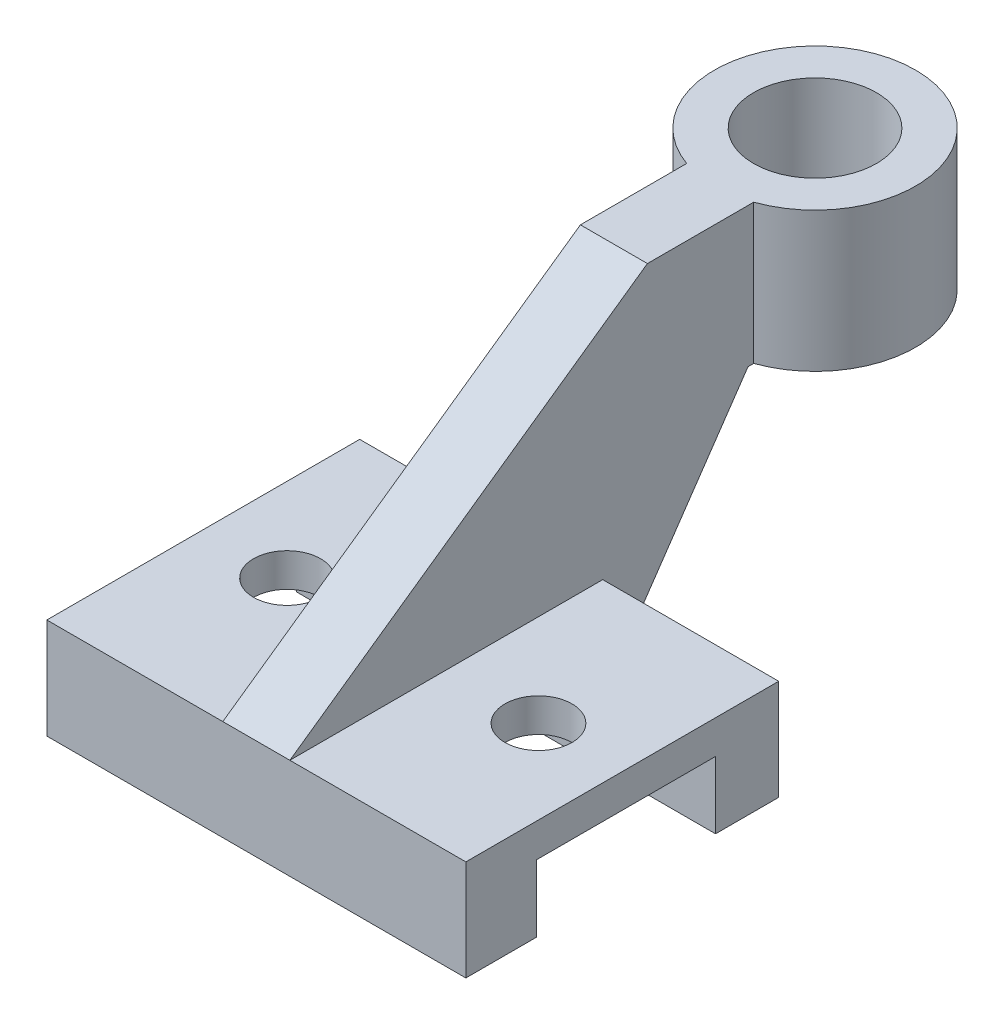
ISO-10303-21;
HEADER;
FILE_DESCRIPTION(('STEP AP214'),'2;1');
FILE_NAME('part.step','',(''),(''),'','','');
FILE_SCHEMA(('AUTOMOTIVE_DESIGN { 1 0 10303 214 1 1 1 1 }'));
ENDSEC;
DATA;
#1=APPLICATION_CONTEXT('core data for automotive mechanical design processes');
#2=APPLICATION_PROTOCOL_DEFINITION('international standard','automotive_design',2000,#1);
#3=PRODUCT_CONTEXT('',#1,'mechanical');
#4=PRODUCT('Part','Part','',(#3));
#5=PRODUCT_RELATED_PRODUCT_CATEGORY('part','',(#4));
#6=PRODUCT_DEFINITION_FORMATION('','',#4);
#7=PRODUCT_DEFINITION_CONTEXT('part definition',#1,'design');
#8=PRODUCT_DEFINITION('design','',#6,#7);
#9=PRODUCT_DEFINITION_SHAPE('','',#8);
#10=(LENGTH_UNIT() NAMED_UNIT(*) SI_UNIT(.MILLI.,.METRE.));
#11=(NAMED_UNIT(*) PLANE_ANGLE_UNIT() SI_UNIT($,.RADIAN.));
#12=(NAMED_UNIT(*) SI_UNIT($,.STERADIAN.) SOLID_ANGLE_UNIT());
#13=UNCERTAINTY_MEASURE_WITH_UNIT(LENGTH_MEASURE(1.E-05),#10,'distance_accuracy_value','');
#14=(GEOMETRIC_REPRESENTATION_CONTEXT(3) GLOBAL_UNCERTAINTY_ASSIGNED_CONTEXT((#13)) GLOBAL_UNIT_ASSIGNED_CONTEXT((#10,
#11,#12)) REPRESENTATION_CONTEXT('',''));
#15=CARTESIAN_POINT('',(0.,0.,0.));
#16=DIRECTION('',(0.,0.,1.));
#17=DIRECTION('',(1.,0.,0.));
#18=AXIS2_PLACEMENT_3D('',#15,#16,#17);
#19=CARTESIAN_POINT('',(952.5,367.568586387434,-1523.46806282722));
#20=DIRECTION('',(0.,1.,0.));
#21=DIRECTION('',(0.,0.,1.));
#22=AXIS2_PLACEMENT_3D('',#19,#20,#21);
#23=CYLINDRICAL_SURFACE('',#22,457.2);
#24=CARTESIAN_POINT('',(952.5,1002.56858638743,-1523.46806282722));
#25=DIRECTION('',(0.,1.,0.));
#26=DIRECTION('',(0.,0.,1.));
#27=AXIS2_PLACEMENT_3D('',#24,#25,#26);
#28=CIRCLE('',#27,457.2);
#29=CARTESIAN_POINT('',(1104.9,1002.56858638743,-1092.4157690159));
#30=VERTEX_POINT('',#29);
#31=CARTESIAN_POINT('',(800.1,1002.56858638743,-1092.4157690159));
#32=VERTEX_POINT('',#31);
#33=EDGE_CURVE('E43',#30,#32,#28,.T.);
#34=ORIENTED_EDGE('',*,*,#33,.F.);
#35=DIRECTION('',(0.,1.,0.));
#36=VECTOR('',#35,1.);
#37=CARTESIAN_POINT('',(1104.9,367.568586387434,-1092.4157690159));
#38=LINE('',#37,#36);
#39=CARTESIAN_POINT('',(1104.9,367.568586387434,-1092.4157690159));
#40=VERTEX_POINT('',#39);
#41=EDGE_CURVE('E150',#30,#40,#38,.F.);
#42=ORIENTED_EDGE('',*,*,#41,.T.);
#43=CARTESIAN_POINT('',(952.5,367.568586387434,-1523.46806282722));
#44=DIRECTION('',(0.,1.,0.));
#45=DIRECTION('',(0.,0.,1.));
#46=AXIS2_PLACEMENT_3D('',#43,#44,#45);
#47=CIRCLE('',#46,457.2);
#48=CARTESIAN_POINT('',(800.1,367.568586387434,-1092.4157690159));
#49=VERTEX_POINT('',#48);
#50=EDGE_CURVE('E11',#40,#49,#47,.T.);
#51=ORIENTED_EDGE('',*,*,#50,.T.);
#52=DIRECTION('',(0.,1.,0.));
#53=VECTOR('',#52,1.);
#54=CARTESIAN_POINT('',(800.1,367.568586387434,-1092.4157690159));
#55=LINE('',#54,#53);
#56=EDGE_CURVE('E268',#49,#32,#55,.T.);
#57=ORIENTED_EDGE('',*,*,#56,.T.);
#58=EDGE_LOOP('',(#34,#42,#51,#57));
#59=FACE_BOUND('',#58,.T.);
#60=ADVANCED_FACE('F40',(#59),#23,.T.);
#61=CARTESIAN_POINT('',(952.5,367.568586387434,-1523.46806282722));
#62=DIRECTION('',(0.,1.,0.));
#63=DIRECTION('',(0.,0.,1.));
#64=AXIS2_PLACEMENT_3D('',#61,#62,#63);
#65=PLANE('',#64);
#66=ORIENTED_EDGE('',*,*,#50,.F.);
#67=DIRECTION('',(0.,0.,1.));
#68=VECTOR('',#67,1.);
#69=CARTESIAN_POINT('',(1104.9,367.568586387434,-1218.66806282722));
#70=LINE('',#69,#68);
#71=CARTESIAN_POINT('',(1104.9,367.568586387434,-1066.26806282722));
#72=VERTEX_POINT('',#71);
#73=EDGE_CURVE('E61',#40,#72,#70,.T.);
#74=ORIENTED_EDGE('',*,*,#73,.T.);
#75=DIRECTION('',(-1.,0.,0.));
#76=VECTOR('',#75,1.);
#77=CARTESIAN_POINT('',(800.1,367.568586387434,-1066.26806282722));
#78=LINE('',#77,#76);
#79=CARTESIAN_POINT('',(800.1,367.568586387434,-1066.26806282722));
#80=VERTEX_POINT('',#79);
#81=EDGE_CURVE('E153',#72,#80,#78,.T.);
#82=ORIENTED_EDGE('',*,*,#81,.T.);
#83=DIRECTION('',(0.,0.,1.));
#84=VECTOR('',#83,1.);
#85=CARTESIAN_POINT('',(800.1,367.568586387434,-1218.66806282722));
#86=LINE('',#85,#84);
#87=EDGE_CURVE('E264',#49,#80,#86,.T.);
#88=ORIENTED_EDGE('',*,*,#87,.F.);
#89=EDGE_LOOP('',(#66,#74,#82,#88));
#90=FACE_BOUND('',#89,.T.);
#91=CARTESIAN_POINT('',(952.5,367.568586387434,-1523.46806282722));
#92=DIRECTION('',(0.,1.,0.));
#93=DIRECTION('',(0.,0.,1.));
#94=AXIS2_PLACEMENT_3D('',#91,#92,#93);
#95=CIRCLE('',#94,279.4);
#96=CARTESIAN_POINT('',(952.5,367.568586387434,-1244.06806282722));
#97=VERTEX_POINT('',#96);
#98=EDGE_CURVE('E273',#97,#97,#95,.T.);
#99=ORIENTED_EDGE('',*,*,#98,.T.);
#100=EDGE_LOOP('',(#99));
#101=FACE_BOUND('',#100,.T.);
#102=ADVANCED_FACE('F281',(#90,#101),#65,.F.);
#103=CARTESIAN_POINT('',(952.5,1002.56858638743,-1523.46806282722));
#104=DIRECTION('',(0.,1.,0.));
#105=DIRECTION('',(0.,0.,1.));
#106=AXIS2_PLACEMENT_3D('',#103,#104,#105);
#107=PLANE('',#106);
#108=ORIENTED_EDGE('',*,*,#33,.T.);
#109=DIRECTION('',(0.,0.,1.));
#110=VECTOR('',#109,1.);
#111=CARTESIAN_POINT('',(800.1,1002.56858638743,-1218.66806282722));
#112=LINE('',#111,#110);
#113=CARTESIAN_POINT('',(800.1,1002.56858638743,-609.068062827224));
#114=VERTEX_POINT('',#113);
#115=EDGE_CURVE('E152',#32,#114,#112,.T.);
#116=ORIENTED_EDGE('',*,*,#115,.T.);
#117=DIRECTION('',(1.,0.,0.));
#118=VECTOR('',#117,1.);
#119=CARTESIAN_POINT('',(800.1,1002.56858638743,-609.068062827224));
#120=LINE('',#119,#118);
#121=CARTESIAN_POINT('',(1104.9,1002.56858638743,-609.068062827224));
#122=VERTEX_POINT('',#121);
#123=EDGE_CURVE('E156',#114,#122,#120,.T.);
#124=ORIENTED_EDGE('',*,*,#123,.T.);
#125=DIRECTION('',(0.,0.,1.));
#126=VECTOR('',#125,1.);
#127=CARTESIAN_POINT('',(1104.9,1002.56858638743,-1218.66806282722));
#128=LINE('',#127,#126);
#129=EDGE_CURVE('E54',#30,#122,#128,.T.);
#130=ORIENTED_EDGE('',*,*,#129,.F.);
#131=EDGE_LOOP('',(#108,#116,#124,#130));
#132=FACE_BOUND('',#131,.T.);
#133=CARTESIAN_POINT('',(952.5,1002.56858638743,-1523.46806282722));
#134=DIRECTION('',(0.,1.,0.));
#135=DIRECTION('',(0.,0.,1.));
#136=AXIS2_PLACEMENT_3D('',#133,#134,#135);
#137=CIRCLE('',#136,279.4);
#138=CARTESIAN_POINT('',(952.5,1002.56858638743,-1244.06806282722));
#139=VERTEX_POINT('',#138);
#140=EDGE_CURVE('E272',#139,#139,#137,.T.);
#141=ORIENTED_EDGE('',*,*,#140,.F.);
#142=EDGE_LOOP('',(#141));
#143=FACE_BOUND('',#142,.T.);
#144=ADVANCED_FACE('F157',(#132,#143),#107,.T.);
#145=CARTESIAN_POINT('',(952.5,367.568586387434,-1523.46806282722));
#146=DIRECTION('',(0.,1.,0.));
#147=DIRECTION('',(0.,0.,1.));
#148=AXIS2_PLACEMENT_3D('',#145,#146,#147);
#149=CYLINDRICAL_SURFACE('',#148,279.4);
#150=ORIENTED_EDGE('',*,*,#98,.F.);
#151=EDGE_LOOP('',(#150));
#152=FACE_BOUND('',#151,.T.);
#153=ORIENTED_EDGE('',*,*,#140,.T.);
#154=EDGE_LOOP('',(#153));
#155=FACE_BOUND('',#154,.T.);
#156=ADVANCED_FACE('F279',(#152,#155),#149,.F.);
#157=CARTESIAN_POINT('',(1104.9,367.568586387434,-1218.66806282722));
#158=DIRECTION('',(-1.,0.,0.));
#159=DIRECTION('',(0.,0.,1.));
#160=AXIS2_PLACEMENT_3D('',#157,#158,#159);
#161=PLANE('',#160);
#162=ORIENTED_EDGE('',*,*,#41,.F.);
#163=ORIENTED_EDGE('',*,*,#129,.T.);
#164=DIRECTION('',(0.,-0.575176751990256,0.818029158386142));
#165=VECTOR('',#164,1.);
#166=CARTESIAN_POINT('',(1104.9,1002.56858638743,-609.068062827224));
#167=LINE('',#166,#165);
#168=CARTESIAN_POINT('',(1104.9,-140.431413612566,1016.53193717278));
#169=VERTEX_POINT('',#168);
#170=EDGE_CURVE('E149',#122,#169,#167,.T.);
#171=ORIENTED_EDGE('',*,*,#170,.T.);
#172=DIRECTION('',(0.,0.,-1.));
#173=VECTOR('',#172,1.);
#174=CARTESIAN_POINT('',(1104.9,-140.431413612566,1016.53193717278));
#175=LINE('',#174,#173);
#176=CARTESIAN_POINT('',(1104.9,-140.431413612566,-405.868062827224));
#177=VERTEX_POINT('',#176);
#178=EDGE_CURVE('E168',#169,#177,#175,.T.);
#179=ORIENTED_EDGE('',*,*,#178,.T.);
#180=DIRECTION('',(0.,-1.,0.));
#181=VECTOR('',#180,1.);
#182=CARTESIAN_POINT('',(1104.9,-140.431413612566,-405.868062827224));
#183=LINE('',#182,#181);
#184=CARTESIAN_POINT('',(1104.9,-597.631413612566,-405.868062827224));
#185=VERTEX_POINT('',#184);
#186=EDGE_CURVE('E171',#177,#185,#183,.T.);
#187=ORIENTED_EDGE('',*,*,#186,.T.);
#188=DIRECTION('',(0.,0.825307261249832,-0.56468391559199));
#189=VECTOR('',#188,1.);
#190=CARTESIAN_POINT('',(1104.9,367.568586387434,-1066.26806282722));
#191=LINE('',#190,#189);
#192=EDGE_CURVE('E182',#185,#72,#191,.T.);
#193=ORIENTED_EDGE('',*,*,#192,.T.);
#194=ORIENTED_EDGE('',*,*,#73,.F.);
#195=EDGE_LOOP('',(#162,#163,#171,#179,#187,#193,#194));
#196=FACE_BOUND('',#195,.T.);
#197=ADVANCED_FACE('F146',(#196),#161,.F.);
#198=CARTESIAN_POINT('',(800.1,1002.56858638743,-1218.66806282722));
#199=DIRECTION('',(1.,0.,0.));
#200=DIRECTION('',(0.,0.,-1.));
#201=AXIS2_PLACEMENT_3D('',#198,#199,#200);
#202=PLANE('',#201);
#203=ORIENTED_EDGE('',*,*,#56,.F.);
#204=ORIENTED_EDGE('',*,*,#87,.T.);
#205=DIRECTION('',(0.,0.825307261249832,-0.56468391559199));
#206=VECTOR('',#205,1.);
#207=CARTESIAN_POINT('',(800.1,367.568586387434,-1066.26806282722));
#208=LINE('',#207,#206);
#209=CARTESIAN_POINT('',(800.1,-597.631413612566,-405.868062827224));
#210=VERTEX_POINT('',#209);
#211=EDGE_CURVE('E163',#210,#80,#208,.T.);
#212=ORIENTED_EDGE('',*,*,#211,.F.);
#213=DIRECTION('',(0.,-1.,0.));
#214=VECTOR('',#213,1.);
#215=CARTESIAN_POINT('',(800.1,-140.431413612566,-405.868062827224));
#216=LINE('',#215,#214);
#217=CARTESIAN_POINT('',(800.1,-140.431413612566,-405.868062827224));
#218=VERTEX_POINT('',#217);
#219=EDGE_CURVE('E188',#218,#210,#216,.T.);
#220=ORIENTED_EDGE('',*,*,#219,.F.);
#221=DIRECTION('',(0.,0.,-1.));
#222=VECTOR('',#221,1.);
#223=CARTESIAN_POINT('',(800.1,-140.431413612566,1016.53193717278));
#224=LINE('',#223,#222);
#225=CARTESIAN_POINT('',(800.1,-140.431413612566,1016.53193717278));
#226=VERTEX_POINT('',#225);
#227=EDGE_CURVE('E186',#226,#218,#224,.T.);
#228=ORIENTED_EDGE('',*,*,#227,.F.);
#229=DIRECTION('',(0.,-0.575176751990256,0.818029158386142));
#230=VECTOR('',#229,1.);
#231=CARTESIAN_POINT('',(800.1,1002.56858638743,-609.068062827224));
#232=LINE('',#231,#230);
#233=EDGE_CURVE('E184',#114,#226,#232,.T.);
#234=ORIENTED_EDGE('',*,*,#233,.F.);
#235=ORIENTED_EDGE('',*,*,#115,.F.);
#236=EDGE_LOOP('',(#203,#204,#212,#220,#228,#234,#235));
#237=FACE_BOUND('',#236,.T.);
#238=ADVANCED_FACE('F297',(#237),#202,.F.);
#239=CARTESIAN_POINT('',(1905.,-140.431413612566,-405.868062827224));
#240=DIRECTION('',(0.,0.,-1.));
#241=DIRECTION('',(0.,1.,0.));
#242=AXIS2_PLACEMENT_3D('',#239,#240,#241);
#243=PLANE('',#242);
#244=DIRECTION('',(-1.,0.,0.));
#245=VECTOR('',#244,1.);
#246=CARTESIAN_POINT('',(1905.,-597.631413612566,-405.868062827224));
#247=LINE('',#246,#245);
#248=CARTESIAN_POINT('',(1905.,-597.631413612566,-405.868062827224));
#249=VERTEX_POINT('',#248);
#250=EDGE_CURVE('E258',#249,#185,#247,.T.);
#251=ORIENTED_EDGE('',*,*,#250,.T.);
#252=ORIENTED_EDGE('',*,*,#186,.F.);
#253=DIRECTION('',(-1.,0.,0.));
#254=VECTOR('',#253,1.);
#255=CARTESIAN_POINT('',(1905.,-140.431413612566,-405.868062827224));
#256=LINE('',#255,#254);
#257=CARTESIAN_POINT('',(1905.,-140.431413612566,-405.868062827224));
#258=VERTEX_POINT('',#257);
#259=EDGE_CURVE('E237',#258,#177,#256,.T.);
#260=ORIENTED_EDGE('',*,*,#259,.F.);
#261=DIRECTION('',(0.,-1.,0.));
#262=VECTOR('',#261,1.);
#263=CARTESIAN_POINT('',(1905.,-140.431413612566,-405.868062827224));
#264=LINE('',#263,#262);
#265=EDGE_CURVE('E196',#258,#249,#264,.T.);
#266=ORIENTED_EDGE('',*,*,#265,.T.);
#267=EDGE_LOOP('',(#251,#252,#260,#266));
#268=FACE_BOUND('',#267,.T.);
#269=ADVANCED_FACE('F305',(#268),#243,.T.);
#270=CARTESIAN_POINT('',(1905.,-140.431413612566,1016.53193717278));
#271=DIRECTION('',(0.,1.,0.));
#272=DIRECTION('',(0.,0.,1.));
#273=AXIS2_PLACEMENT_3D('',#270,#271,#272);
#274=PLANE('',#273);
#275=CARTESIAN_POINT('',(1524.,-140.431413612566,305.331937172776));
#276=DIRECTION('',(0.,1.,0.));
#277=DIRECTION('',(0.,0.,1.));
#278=AXIS2_PLACEMENT_3D('',#275,#276,#277);
#279=CIRCLE('',#278,152.4);
#280=CARTESIAN_POINT('',(1524.,-140.431413612566,457.731937172776));
#281=VERTEX_POINT('',#280);
#282=EDGE_CURVE('E174',#281,#281,#279,.T.);
#283=ORIENTED_EDGE('',*,*,#282,.F.);
#284=EDGE_LOOP('',(#283));
#285=FACE_BOUND('',#284,.T.);
#286=ORIENTED_EDGE('',*,*,#259,.T.);
#287=ORIENTED_EDGE('',*,*,#178,.F.);
#288=DIRECTION('',(-1.,0.,0.));
#289=VECTOR('',#288,1.);
#290=CARTESIAN_POINT('',(1905.,-140.431413612566,1016.53193717278));
#291=LINE('',#290,#289);
#292=CARTESIAN_POINT('',(1905.,-140.431413612566,1016.53193717278));
#293=VERTEX_POINT('',#292);
#294=EDGE_CURVE('E241',#293,#169,#291,.T.);
#295=ORIENTED_EDGE('',*,*,#294,.F.);
#296=DIRECTION('',(0.,0.,-1.));
#297=VECTOR('',#296,1.);
#298=CARTESIAN_POINT('',(1905.,-140.431413612566,1016.53193717278));
#299=LINE('',#298,#297);
#300=EDGE_CURVE('E214',#293,#258,#299,.T.);
#301=ORIENTED_EDGE('',*,*,#300,.T.);
#302=EDGE_LOOP('',(#286,#287,#295,#301));
#303=FACE_BOUND('',#302,.T.);
#304=ADVANCED_FACE('F308',(#285,#303),#274,.T.);
#305=ORIENTED_EDGE('',*,*,#219,.T.);
#306=CARTESIAN_POINT('',(0.,-597.631413612566,-405.868062827224));
#307=VERTEX_POINT('',#306);
#308=EDGE_CURVE('E217',#210,#307,#247,.T.);
#309=ORIENTED_EDGE('',*,*,#308,.T.);
#310=DIRECTION('',(0.,-1.,0.));
#311=VECTOR('',#310,1.);
#312=CARTESIAN_POINT('',(0.,-140.431413612566,-405.868062827224));
#313=LINE('',#312,#311);
#314=CARTESIAN_POINT('',(0.,-140.431413612566,-405.868062827224));
#315=VERTEX_POINT('',#314);
#316=EDGE_CURVE('E194',#315,#307,#313,.T.);
#317=ORIENTED_EDGE('',*,*,#316,.F.);
#318=EDGE_CURVE('E240',#218,#315,#256,.T.);
#319=ORIENTED_EDGE('',*,*,#318,.F.);
#320=EDGE_LOOP('',(#305,#309,#317,#319));
#321=FACE_BOUND('',#320,.T.);
#322=ADVANCED_FACE('F323',(#321),#243,.T.);
#323=CARTESIAN_POINT('',(381.,-140.431413612566,305.331937172776));
#324=DIRECTION('',(0.,1.,0.));
#325=DIRECTION('',(0.,0.,1.));
#326=AXIS2_PLACEMENT_3D('',#323,#324,#325);
#327=CIRCLE('',#326,152.4);
#328=CARTESIAN_POINT('',(381.,-140.431413612566,457.731937172776));
#329=VERTEX_POINT('',#328);
#330=EDGE_CURVE('E543',#329,#329,#327,.T.);
#331=ORIENTED_EDGE('',*,*,#330,.F.);
#332=EDGE_LOOP('',(#331));
#333=FACE_BOUND('',#332,.T.);
#334=ORIENTED_EDGE('',*,*,#227,.T.);
#335=ORIENTED_EDGE('',*,*,#318,.T.);
#336=DIRECTION('',(0.,0.,-1.));
#337=VECTOR('',#336,1.);
#338=CARTESIAN_POINT('',(0.,-140.431413612566,1016.53193717278));
#339=LINE('',#338,#337);
#340=CARTESIAN_POINT('',(0.,-140.431413612566,1016.53193717278));
#341=VERTEX_POINT('',#340);
#342=EDGE_CURVE('E200',#341,#315,#339,.T.);
#343=ORIENTED_EDGE('',*,*,#342,.F.);
#344=EDGE_CURVE('E244',#226,#341,#291,.T.);
#345=ORIENTED_EDGE('',*,*,#344,.F.);
#346=EDGE_LOOP('',(#334,#335,#343,#345));
#347=FACE_BOUND('',#346,.T.);
#348=ADVANCED_FACE('F327',(#333,#347),#274,.T.);
#349=CARTESIAN_POINT('',(1905.,-597.631413612566,1016.53193717278));
#350=DIRECTION('',(0.,0.,1.));
#351=DIRECTION('',(1.,0.,0.));
#352=AXIS2_PLACEMENT_3D('',#349,#350,#351);
#353=PLANE('',#352);
#354=DIRECTION('',(0.,1.,0.));
#355=VECTOR('',#354,1.);
#356=CARTESIAN_POINT('',(0.,-597.631413612566,1016.53193717278));
#357=LINE('',#356,#355);
#358=CARTESIAN_POINT('',(0.,-597.631413612566,1016.53193717278));
#359=VERTEX_POINT('',#358);
#360=EDGE_CURVE('E232',#359,#341,#357,.T.);
#361=ORIENTED_EDGE('',*,*,#360,.F.);
#362=DIRECTION('',(-1.,0.,0.));
#363=VECTOR('',#362,1.);
#364=CARTESIAN_POINT('',(1905.,-597.631413612566,1016.53193717278));
#365=LINE('',#364,#363);
#366=CARTESIAN_POINT('',(1905.,-597.631413612566,1016.53193717278));
#367=VERTEX_POINT('',#366);
#368=EDGE_CURVE('E245',#367,#359,#365,.T.);
#369=ORIENTED_EDGE('',*,*,#368,.F.);
#370=DIRECTION('',(0.,1.,0.));
#371=VECTOR('',#370,1.);
#372=CARTESIAN_POINT('',(1905.,-597.631413612566,1016.53193717278));
#373=LINE('',#372,#371);
#374=EDGE_CURVE('E211',#367,#293,#373,.T.);
#375=ORIENTED_EDGE('',*,*,#374,.T.);
#376=ORIENTED_EDGE('',*,*,#294,.T.);
#377=DIRECTION('',(1.,0.,0.));
#378=VECTOR('',#377,1.);
#379=CARTESIAN_POINT('',(800.1,-140.431413612566,1016.53193717278));
#380=LINE('',#379,#378);
#381=EDGE_CURVE('E162',#226,#169,#380,.T.);
#382=ORIENTED_EDGE('',*,*,#381,.F.);
#383=ORIENTED_EDGE('',*,*,#344,.T.);
#384=EDGE_LOOP('',(#361,#369,#375,#376,#382,#383));
#385=FACE_BOUND('',#384,.T.);
#386=ADVANCED_FACE('F330',(#385),#353,.T.);
#387=CARTESIAN_POINT('',(1905.,-597.631413612566,1016.53193717278));
#388=DIRECTION('',(0.,1.,0.));
#389=DIRECTION('',(0.,0.,1.));
#390=AXIS2_PLACEMENT_3D('',#387,#388,#389);
#391=PLANE('',#390);
#392=DIRECTION('',(0.,0.,-1.));
#393=VECTOR('',#392,1.);
#394=CARTESIAN_POINT('',(0.,-597.631413612566,1016.53193717278));
#395=LINE('',#394,#393);
#396=CARTESIAN_POINT('',(0.,-597.631413612566,694.178010471205));
#397=VERTEX_POINT('',#396);
#398=EDGE_CURVE('E230',#359,#397,#395,.T.);
#399=ORIENTED_EDGE('',*,*,#398,.T.);
#400=DIRECTION('',(-1.,0.,0.));
#401=VECTOR('',#400,1.);
#402=CARTESIAN_POINT('',(1905.,-597.631413612566,694.178010471205));
#403=LINE('',#402,#401);
#404=CARTESIAN_POINT('',(1905.,-597.631413612566,694.178010471205));
#405=VERTEX_POINT('',#404);
#406=EDGE_CURVE('E247',#405,#397,#403,.T.);
#407=ORIENTED_EDGE('',*,*,#406,.F.);
#408=DIRECTION('',(0.,0.,-1.));
#409=VECTOR('',#408,1.);
#410=CARTESIAN_POINT('',(1905.,-597.631413612566,1016.53193717278));
#411=LINE('',#410,#409);
#412=EDGE_CURVE('E209',#367,#405,#411,.T.);
#413=ORIENTED_EDGE('',*,*,#412,.F.);
#414=ORIENTED_EDGE('',*,*,#368,.T.);
#415=EDGE_LOOP('',(#399,#407,#413,#414));
#416=FACE_BOUND('',#415,.T.);
#417=ADVANCED_FACE('F335',(#416),#391,.F.);
#418=CARTESIAN_POINT('',(1905.,-597.631413612566,694.178010471205));
#419=DIRECTION('',(0.,0.,1.));
#420=DIRECTION('',(1.,0.,0.));
#421=AXIS2_PLACEMENT_3D('',#418,#419,#420);
#422=PLANE('',#421);
#423=DIRECTION('',(0.,1.,0.));
#424=VECTOR('',#423,1.);
#425=CARTESIAN_POINT('',(0.,-597.631413612566,694.178010471205));
#426=LINE('',#425,#424);
#427=CARTESIAN_POINT('',(0.,-292.831413612566,694.178010471205));
#428=VERTEX_POINT('',#427);
#429=EDGE_CURVE('E228',#397,#428,#426,.T.);
#430=ORIENTED_EDGE('',*,*,#429,.T.);
#431=DIRECTION('',(-1.,0.,0.));
#432=VECTOR('',#431,1.);
#433=CARTESIAN_POINT('',(1905.,-292.831413612566,694.178010471205));
#434=LINE('',#433,#432);
#435=CARTESIAN_POINT('',(1905.,-292.831413612566,694.178010471205));
#436=VERTEX_POINT('',#435);
#437=EDGE_CURVE('E250',#436,#428,#434,.T.);
#438=ORIENTED_EDGE('',*,*,#437,.F.);
#439=DIRECTION('',(0.,1.,0.));
#440=VECTOR('',#439,1.);
#441=CARTESIAN_POINT('',(1905.,-597.631413612566,694.178010471205));
#442=LINE('',#441,#440);
#443=EDGE_CURVE('E207',#405,#436,#442,.T.);
#444=ORIENTED_EDGE('',*,*,#443,.F.);
#445=ORIENTED_EDGE('',*,*,#406,.T.);
#446=EDGE_LOOP('',(#430,#438,#444,#445));
#447=FACE_BOUND('',#446,.T.);
#448=ADVANCED_FACE('F341',(#447),#422,.F.);
#449=CARTESIAN_POINT('',(1905.,-292.831413612566,694.178010471205));
#450=DIRECTION('',(0.,1.,0.));
#451=DIRECTION('',(0.,0.,1.));
#452=AXIS2_PLACEMENT_3D('',#449,#450,#451);
#453=PLANE('',#452);
#454=CARTESIAN_POINT('',(1524.,-292.831413612566,305.331937172776));
#455=DIRECTION('',(0.,1.,0.));
#456=DIRECTION('',(0.,0.,1.));
#457=AXIS2_PLACEMENT_3D('',#454,#455,#456);
#458=CIRCLE('',#457,152.4);
#459=CARTESIAN_POINT('',(1524.,-292.831413612566,457.731937172776));
#460=VERTEX_POINT('',#459);
#461=EDGE_CURVE('E169',#460,#460,#458,.F.);
#462=ORIENTED_EDGE('',*,*,#461,.F.);
#463=EDGE_LOOP('',(#462));
#464=FACE_BOUND('',#463,.T.);
#465=CARTESIAN_POINT('',(381.,-292.831413612566,305.331937172776));
#466=DIRECTION('',(0.,1.,0.));
#467=DIRECTION('',(0.,0.,1.));
#468=AXIS2_PLACEMENT_3D('',#465,#466,#467);
#469=CIRCLE('',#468,152.4);
#470=CARTESIAN_POINT('',(381.,-292.831413612566,457.731937172776));
#471=VERTEX_POINT('',#470);
#472=EDGE_CURVE('E177',#471,#471,#469,.F.);
#473=ORIENTED_EDGE('',*,*,#472,.F.);
#474=EDGE_LOOP('',(#473));
#475=FACE_BOUND('',#474,.T.);
#476=DIRECTION('',(0.,0.,-1.));
#477=VECTOR('',#476,1.);
#478=CARTESIAN_POINT('',(0.,-292.831413612566,694.178010471205));
#479=LINE('',#478,#477);
#480=CARTESIAN_POINT('',(0.,-292.831413612566,-118.621989528795));
#481=VERTEX_POINT('',#480);
#482=EDGE_CURVE('E226',#428,#481,#479,.T.);
#483=ORIENTED_EDGE('',*,*,#482,.T.);
#484=DIRECTION('',(-1.,0.,0.));
#485=VECTOR('',#484,1.);
#486=CARTESIAN_POINT('',(1905.,-292.831413612566,-118.621989528795));
#487=LINE('',#486,#485);
#488=CARTESIAN_POINT('',(1905.,-292.831413612566,-118.621989528795));
#489=VERTEX_POINT('',#488);
#490=EDGE_CURVE('E253',#489,#481,#487,.T.);
#491=ORIENTED_EDGE('',*,*,#490,.F.);
#492=DIRECTION('',(0.,0.,-1.));
#493=VECTOR('',#492,1.);
#494=CARTESIAN_POINT('',(1905.,-292.831413612566,694.178010471205));
#495=LINE('',#494,#493);
#496=EDGE_CURVE('E205',#436,#489,#495,.T.);
#497=ORIENTED_EDGE('',*,*,#496,.F.);
#498=ORIENTED_EDGE('',*,*,#437,.T.);
#499=EDGE_LOOP('',(#483,#491,#497,#498));
#500=FACE_BOUND('',#499,.T.);
#501=ADVANCED_FACE('F345',(#464,#475,#500),#453,.F.);
#502=CARTESIAN_POINT('',(1905.,-292.831413612566,-118.621989528795));
#503=DIRECTION('',(0.,0.,-1.));
#504=DIRECTION('',(0.,1.,0.));
#505=AXIS2_PLACEMENT_3D('',#502,#503,#504);
#506=PLANE('',#505);
#507=DIRECTION('',(0.,-1.,0.));
#508=VECTOR('',#507,1.);
#509=CARTESIAN_POINT('',(0.,-292.831413612566,-118.621989528795));
#510=LINE('',#509,#508);
#511=CARTESIAN_POINT('',(0.,-597.631413612566,-118.621989528795));
#512=VERTEX_POINT('',#511);
#513=EDGE_CURVE('E223',#481,#512,#510,.T.);
#514=ORIENTED_EDGE('',*,*,#513,.T.);
#515=DIRECTION('',(-1.,0.,0.));
#516=VECTOR('',#515,1.);
#517=CARTESIAN_POINT('',(1905.,-597.631413612566,-118.621989528795));
#518=LINE('',#517,#516);
#519=CARTESIAN_POINT('',(1905.,-597.631413612566,-118.621989528795));
#520=VERTEX_POINT('',#519);
#521=EDGE_CURVE('E256',#520,#512,#518,.T.);
#522=ORIENTED_EDGE('',*,*,#521,.F.);
#523=DIRECTION('',(0.,-1.,0.));
#524=VECTOR('',#523,1.);
#525=CARTESIAN_POINT('',(1905.,-292.831413612566,-118.621989528795));
#526=LINE('',#525,#524);
#527=EDGE_CURVE('E203',#489,#520,#526,.T.);
#528=ORIENTED_EDGE('',*,*,#527,.F.);
#529=ORIENTED_EDGE('',*,*,#490,.T.);
#530=EDGE_LOOP('',(#514,#522,#528,#529));
#531=FACE_BOUND('',#530,.T.);
#532=ADVANCED_FACE('F348',(#531),#506,.F.);
#533=CARTESIAN_POINT('',(1905.,-597.631413612566,-405.868062827224));
#534=DIRECTION('',(0.,-1.,0.));
#535=DIRECTION('',(0.,0.,-1.));
#536=AXIS2_PLACEMENT_3D('',#533,#534,#535);
#537=PLANE('',#536);
#538=DIRECTION('',(0.,0.,1.));
#539=VECTOR('',#538,1.);
#540=CARTESIAN_POINT('',(0.,-597.631413612566,-405.868062827224));
#541=LINE('',#540,#539);
#542=EDGE_CURVE('E220',#307,#512,#541,.T.);
#543=ORIENTED_EDGE('',*,*,#542,.F.);
#544=ORIENTED_EDGE('',*,*,#308,.F.);
#545=DIRECTION('',(1.,0.,0.));
#546=VECTOR('',#545,1.);
#547=CARTESIAN_POINT('',(800.1,-597.631413612566,-405.868062827224));
#548=LINE('',#547,#546);
#549=EDGE_CURVE('E192',#210,#185,#548,.T.);
#550=ORIENTED_EDGE('',*,*,#549,.T.);
#551=ORIENTED_EDGE('',*,*,#250,.F.);
#552=DIRECTION('',(0.,0.,1.));
#553=VECTOR('',#552,1.);
#554=CARTESIAN_POINT('',(1905.,-597.631413612566,-405.868062827224));
#555=LINE('',#554,#553);
#556=EDGE_CURVE('E199',#249,#520,#555,.T.);
#557=ORIENTED_EDGE('',*,*,#556,.T.);
#558=ORIENTED_EDGE('',*,*,#521,.T.);
#559=EDGE_LOOP('',(#543,#544,#550,#551,#557,#558));
#560=FACE_BOUND('',#559,.T.);
#561=ADVANCED_FACE('F318',(#560),#537,.T.);
#562=CARTESIAN_POINT('',(1905.,0.,0.));
#563=DIRECTION('',(-1.,0.,0.));
#564=DIRECTION('',(0.,0.,1.));
#565=AXIS2_PLACEMENT_3D('',#562,#563,#564);
#566=PLANE('',#565);
#567=ORIENTED_EDGE('',*,*,#265,.F.);
#568=ORIENTED_EDGE('',*,*,#300,.F.);
#569=ORIENTED_EDGE('',*,*,#374,.F.);
#570=ORIENTED_EDGE('',*,*,#412,.T.);
#571=ORIENTED_EDGE('',*,*,#443,.T.);
#572=ORIENTED_EDGE('',*,*,#496,.T.);
#573=ORIENTED_EDGE('',*,*,#527,.T.);
#574=ORIENTED_EDGE('',*,*,#556,.F.);
#575=EDGE_LOOP('',(#567,#568,#569,#570,#571,#572,#573,#574));
#576=FACE_BOUND('',#575,.T.);
#577=ADVANCED_FACE('F312',(#576),#566,.F.);
#578=CARTESIAN_POINT('',(0.,0.,0.));
#579=DIRECTION('',(-1.,0.,0.));
#580=DIRECTION('',(0.,0.,1.));
#581=AXIS2_PLACEMENT_3D('',#578,#579,#580);
#582=PLANE('',#581);
#583=ORIENTED_EDGE('',*,*,#316,.T.);
#584=ORIENTED_EDGE('',*,*,#542,.T.);
#585=ORIENTED_EDGE('',*,*,#513,.F.);
#586=ORIENTED_EDGE('',*,*,#482,.F.);
#587=ORIENTED_EDGE('',*,*,#429,.F.);
#588=ORIENTED_EDGE('',*,*,#398,.F.);
#589=ORIENTED_EDGE('',*,*,#360,.T.);
#590=ORIENTED_EDGE('',*,*,#342,.T.);
#591=EDGE_LOOP('',(#583,#584,#585,#586,#587,#588,#589,#590));
#592=FACE_BOUND('',#591,.T.);
#593=ADVANCED_FACE('F350',(#592),#582,.T.);
#594=CARTESIAN_POINT('',(800.1,367.568586387434,-1066.26806282722));
#595=DIRECTION('',(0.,-0.56468391559199,-0.825307261249832));
#596=DIRECTION('',(0.,0.825307261249832,-0.56468391559199));
#597=AXIS2_PLACEMENT_3D('',#594,#595,#596);
#598=PLANE('',#597);
#599=ORIENTED_EDGE('',*,*,#81,.F.);
#600=ORIENTED_EDGE('',*,*,#192,.F.);
#601=ORIENTED_EDGE('',*,*,#549,.F.);
#602=ORIENTED_EDGE('',*,*,#211,.T.);
#603=EDGE_LOOP('',(#599,#600,#601,#602));
#604=FACE_BOUND('',#603,.T.);
#605=ADVANCED_FACE('F302',(#604),#598,.T.);
#606=CARTESIAN_POINT('',(800.1,1002.56858638743,-609.068062827224));
#607=DIRECTION('',(0.,0.818029158386142,0.575176751990256));
#608=DIRECTION('',(0.,-0.575176751990256,0.818029158386142));
#609=AXIS2_PLACEMENT_3D('',#606,#607,#608);
#610=PLANE('',#609);
#611=ORIENTED_EDGE('',*,*,#381,.T.);
#612=ORIENTED_EDGE('',*,*,#170,.F.);
#613=ORIENTED_EDGE('',*,*,#123,.F.);
#614=ORIENTED_EDGE('',*,*,#233,.T.);
#615=EDGE_LOOP('',(#611,#612,#613,#614));
#616=FACE_BOUND('',#615,.T.);
#617=ADVANCED_FACE('F166',(#616),#610,.T.);
#618=CARTESIAN_POINT('',(381.,-597.632413612566,305.331937172776));
#619=DIRECTION('',(0.,1.,0.));
#620=DIRECTION('',(0.,0.,1.));
#621=AXIS2_PLACEMENT_3D('',#618,#619,#620);
#622=CYLINDRICAL_SURFACE('',#621,152.4);
#623=ORIENTED_EDGE('',*,*,#330,.T.);
#624=EDGE_LOOP('',(#623));
#625=FACE_BOUND('',#624,.T.);
#626=ORIENTED_EDGE('',*,*,#472,.T.);
#627=EDGE_LOOP('',(#626));
#628=FACE_BOUND('',#627,.T.);
#629=ADVANCED_FACE('F456',(#625,#628),#622,.F.);
#630=CARTESIAN_POINT('',(1524.,-597.632413612566,305.331937172776));
#631=DIRECTION('',(0.,1.,0.));
#632=DIRECTION('',(0.,0.,1.));
#633=AXIS2_PLACEMENT_3D('',#630,#631,#632);
#634=CYLINDRICAL_SURFACE('',#633,152.4);
#635=ORIENTED_EDGE('',*,*,#282,.T.);
#636=EDGE_LOOP('',(#635));
#637=FACE_BOUND('',#636,.T.);
#638=ORIENTED_EDGE('',*,*,#461,.T.);
#639=EDGE_LOOP('',(#638));
#640=FACE_BOUND('',#639,.T.);
#641=ADVANCED_FACE('F464',(#637,#640),#634,.F.);
#642=CLOSED_SHELL('',(#60,#102,#144,#156,#197,#238,#269,#304,#322,#348,#386,#417,#448,#501,#532,
#561,#577,#593,#605,#617,#629,#641));
#643=MANIFOLD_SOLID_BREP('B2',#642);
#644=ADVANCED_BREP_SHAPE_REPRESENTATION('',(#18,#643),#14);
#645=SHAPE_DEFINITION_REPRESENTATION(#9,#644);
ENDSEC;
END-ISO-10303-21;
